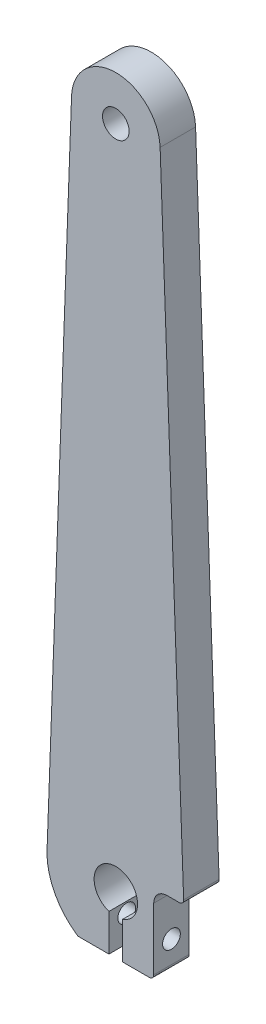
ISO-10303-21;
HEADER;
FILE_DESCRIPTION(('STEP AP214'),'2;1');
FILE_NAME('part.step','',(''),(''),'','','');
FILE_SCHEMA(('AUTOMOTIVE_DESIGN { 1 0 10303 214 1 1 1 1 }'));
ENDSEC;
DATA;
#1=APPLICATION_CONTEXT('core data for automotive mechanical design processes');
#2=APPLICATION_PROTOCOL_DEFINITION('international standard','automotive_design',2000,#1);
#3=PRODUCT_CONTEXT('',#1,'mechanical');
#4=PRODUCT('Part','Part','',(#3));
#5=PRODUCT_RELATED_PRODUCT_CATEGORY('part','',(#4));
#6=PRODUCT_DEFINITION_FORMATION('','',#4);
#7=PRODUCT_DEFINITION_CONTEXT('part definition',#1,'design');
#8=PRODUCT_DEFINITION('design','',#6,#7);
#9=PRODUCT_DEFINITION_SHAPE('','',#8);
#10=(LENGTH_UNIT() NAMED_UNIT(*) SI_UNIT(.MILLI.,.METRE.));
#11=(NAMED_UNIT(*) PLANE_ANGLE_UNIT() SI_UNIT($,.RADIAN.));
#12=(NAMED_UNIT(*) SI_UNIT($,.STERADIAN.) SOLID_ANGLE_UNIT());
#13=UNCERTAINTY_MEASURE_WITH_UNIT(LENGTH_MEASURE(1.E-05),#10,'distance_accuracy_value','');
#14=(GEOMETRIC_REPRESENTATION_CONTEXT(3) GLOBAL_UNCERTAINTY_ASSIGNED_CONTEXT((#13)) GLOBAL_UNIT_ASSIGNED_CONTEXT((#10,
#11,#12)) REPRESENTATION_CONTEXT('',''));
#15=CARTESIAN_POINT('',(0.,0.,0.));
#16=DIRECTION('',(0.,0.,1.));
#17=DIRECTION('',(1.,0.,0.));
#18=AXIS2_PLACEMENT_3D('',#15,#16,#17);
#19=CARTESIAN_POINT('',(0.,0.,8.));
#20=DIRECTION('',(0.,0.,-1.));
#21=DIRECTION('',(-1.,0.,0.));
#22=AXIS2_PLACEMENT_3D('',#19,#20,#21);
#23=PLANE('',#22);
#24=CARTESIAN_POINT('',(0.,76.5,8.));
#25=DIRECTION('',(0.,0.,1.));
#26=DIRECTION('',(1.,0.,0.));
#27=AXIS2_PLACEMENT_3D('',#24,#25,#26);
#28=CIRCLE('',#27,3.);
#29=CARTESIAN_POINT('',(3.,76.5,8.));
#30=VERTEX_POINT('',#29);
#31=EDGE_CURVE('E251',#30,#30,#28,.T.);
#32=ORIENTED_EDGE('',*,*,#31,.F.);
#33=EDGE_LOOP('',(#32));
#34=FACE_BOUND('',#33,.T.);
#35=CARTESIAN_POINT('',(0.,-73.5,8.));
#36=DIRECTION('',(0.,0.,1.));
#37=DIRECTION('',(1.,0.,0.));
#38=AXIS2_PLACEMENT_3D('',#35,#36,#37);
#39=CIRCLE('',#38,15.55);
#40=CARTESIAN_POINT('',(-15.4599665783032,-71.8290920439028,8.));
#41=VERTEX_POINT('',#40);
#42=CARTESIAN_POINT('',(-8.66013745469483,-86.4152823920266,8.));
#43=VERTEX_POINT('',#42);
#44=EDGE_CURVE('E205',#41,#43,#39,.T.);
#45=ORIENTED_EDGE('',*,*,#44,.T.);
#46=CARTESIAN_POINT('',(-8.38167644328986,-86.,8.));
#47=DIRECTION('',(0.,0.,-1.));
#48=DIRECTION('',(-1.,0.,0.));
#49=AXIS2_PLACEMENT_3D('',#46,#47,#48);
#50=CIRCLE('',#49,0.5);
#51=CARTESIAN_POINT('',(-8.38167644328986,-86.5,8.));
#52=VERTEX_POINT('',#51);
#53=EDGE_CURVE('E103',#43,#52,#50,.F.);
#54=ORIENTED_EDGE('',*,*,#53,.T.);
#55=DIRECTION('',(1.,0.,0.));
#56=VECTOR('',#55,1.);
#57=CARTESIAN_POINT('',(-16.,-86.5,8.));
#58=LINE('',#57,#56);
#59=CARTESIAN_POINT('',(-1.55,-86.5,8.));
#60=VERTEX_POINT('',#59);
#61=EDGE_CURVE('E299',#52,#60,#58,.T.);
#62=ORIENTED_EDGE('',*,*,#61,.T.);
#63=DIRECTION('',(0.,1.,0.));
#64=VECTOR('',#63,1.);
#65=CARTESIAN_POINT('',(-1.54999999999993,0.,8.));
#66=LINE('',#65,#64);
#67=CARTESIAN_POINT('',(-1.54999999999999,-78.15,8.));
#68=VERTEX_POINT('',#67);
#69=EDGE_CURVE('E256',#60,#68,#66,.T.);
#70=ORIENTED_EDGE('',*,*,#69,.T.);
#71=DIRECTION('',(1.,0.,0.));
#72=VECTOR('',#71,1.);
#73=CARTESIAN_POINT('',(0.,-78.15,8.));
#74=LINE('',#73,#72);
#75=CARTESIAN_POINT('',(-1.54515371403625,-78.15,8.));
#76=VERTEX_POINT('',#75);
#77=EDGE_CURVE('E277',#68,#76,#74,.T.);
#78=ORIENTED_EDGE('',*,*,#77,.T.);
#79=CARTESIAN_POINT('',(0.,-73.5,8.));
#80=DIRECTION('',(0.,0.,1.));
#81=DIRECTION('',(1.,0.,0.));
#82=AXIS2_PLACEMENT_3D('',#79,#80,#81);
#83=CIRCLE('',#82,4.9);
#84=CARTESIAN_POINT('',(1.54515371403625,-78.15,8.));
#85=VERTEX_POINT('',#84);
#86=EDGE_CURVE('E274',#85,#76,#83,.T.);
#87=ORIENTED_EDGE('',*,*,#86,.F.);
#88=DIRECTION('',(1.,0.,0.));
#89=VECTOR('',#88,1.);
#90=CARTESIAN_POINT('',(0.,-78.15,8.));
#91=LINE('',#90,#89);
#92=CARTESIAN_POINT('',(1.55000000000001,-78.15,8.));
#93=VERTEX_POINT('',#92);
#94=EDGE_CURVE('E270',#85,#93,#91,.T.);
#95=ORIENTED_EDGE('',*,*,#94,.T.);
#96=DIRECTION('',(0.,1.,0.));
#97=VECTOR('',#96,1.);
#98=CARTESIAN_POINT('',(1.55000000000011,0.,8.));
#99=LINE('',#98,#97);
#100=CARTESIAN_POINT('',(1.55,-86.5,8.));
#101=VERTEX_POINT('',#100);
#102=EDGE_CURVE('E267',#101,#93,#99,.T.);
#103=ORIENTED_EDGE('',*,*,#102,.F.);
#104=CARTESIAN_POINT('',(7.55,-86.5,8.));
#105=VERTEX_POINT('',#104);
#106=EDGE_CURVE('E302',#101,#105,#58,.T.);
#107=ORIENTED_EDGE('',*,*,#106,.T.);
#108=CARTESIAN_POINT('',(7.55,-85.5,8.));
#109=DIRECTION('',(0.,0.,-1.));
#110=DIRECTION('',(-1.,0.,0.));
#111=AXIS2_PLACEMENT_3D('',#108,#109,#110);
#112=CIRCLE('',#111,1.);
#113=CARTESIAN_POINT('',(8.55,-85.5,8.));
#114=VERTEX_POINT('',#113);
#115=EDGE_CURVE('E307',#105,#114,#112,.F.);
#116=ORIENTED_EDGE('',*,*,#115,.T.);
#117=DIRECTION('',(0.,1.,0.));
#118=VECTOR('',#117,1.);
#119=CARTESIAN_POINT('',(8.55,0.,8.));
#120=LINE('',#119,#118);
#121=CARTESIAN_POINT('',(8.55,-71.5,8.));
#122=VERTEX_POINT('',#121);
#123=EDGE_CURVE('E234',#114,#122,#120,.T.);
#124=ORIENTED_EDGE('',*,*,#123,.T.);
#125=CARTESIAN_POINT('',(11.55,-71.5,8.));
#126=DIRECTION('',(0.,0.,-1.));
#127=DIRECTION('',(-1.,0.,0.));
#128=AXIS2_PLACEMENT_3D('',#125,#126,#127);
#129=CIRCLE('',#128,3.);
#130=CARTESIAN_POINT('',(11.55,-68.5,8.));
#131=VERTEX_POINT('',#130);
#132=EDGE_CURVE('E328',#122,#131,#129,.T.);
#133=ORIENTED_EDGE('',*,*,#132,.T.);
#134=DIRECTION('',(1.,0.,0.));
#135=VECTOR('',#134,1.);
#136=CARTESIAN_POINT('',(-1.40041945428093E-13,-68.5,8.));
#137=LINE('',#136,#135);
#138=CARTESIAN_POINT('',(14.3007254273132,-68.5,8.));
#139=VERTEX_POINT('',#138);
#140=EDGE_CURVE('E245',#131,#139,#137,.T.);
#141=ORIENTED_EDGE('',*,*,#140,.T.);
#142=CARTESIAN_POINT('',(14.3007254273132,-67.5,8.));
#143=DIRECTION('',(0.,0.,-1.));
#144=DIRECTION('',(-1.,0.,0.));
#145=AXIS2_PLACEMENT_3D('',#142,#143,#144);
#146=CIRCLE('',#145,1.);
#147=CARTESIAN_POINT('',(15.3000501557592,-67.4632564683734,8.));
#148=VERTEX_POINT('',#147);
#149=EDGE_CURVE('E316',#139,#148,#146,.F.);
#150=ORIENTED_EDGE('',*,*,#149,.T.);
#151=DIRECTION('',(-0.036743531626598,0.999324728445967,0.));
#152=VECTOR('',#151,1.);
#153=CARTESIAN_POINT('',(12.8022293464742,0.470716980670182,8.));
#154=LINE('',#153,#152);
#155=CARTESIAN_POINT('',(9.99324728445966,76.867435316266,8.));
#156=VERTEX_POINT('',#155);
#157=EDGE_CURVE('E243',#148,#156,#154,.T.);
#158=ORIENTED_EDGE('',*,*,#157,.T.);
#159=CARTESIAN_POINT('',(0.,76.5,8.));
#160=DIRECTION('',(0.,0.,1.));
#161=DIRECTION('',(1.,0.,0.));
#162=AXIS2_PLACEMENT_3D('',#159,#160,#161);
#163=CIRCLE('',#162,10.);
#164=CARTESIAN_POINT('',(-10.,76.5,8.));
#165=VERTEX_POINT('',#164);
#166=EDGE_CURVE('E229',#156,#165,#163,.T.);
#167=ORIENTED_EDGE('',*,*,#166,.T.);
#168=DIRECTION('',(0.0367849033037923,0.99932320641969,0.));
#169=VECTOR('',#168,1.);
#170=CARTESIAN_POINT('',(-12.7986092839692,0.471114452170644,8.));
#171=LINE('',#170,#169);
#172=EDGE_CURVE('E221',#41,#165,#171,.T.);
#173=ORIENTED_EDGE('',*,*,#172,.F.);
#174=EDGE_LOOP('',(#45,#54,#62,#70,#78,#87,#95,#103,#107,#116,#124,#133,#141,#150,#158,#167,#173));
#175=FACE_BOUND('',#174,.T.);
#176=ADVANCED_FACE('F75',(#34,#175),#23,.F.);
#177=CARTESIAN_POINT('',(0.,0.,0.));
#178=DIRECTION('',(0.,0.,-1.));
#179=DIRECTION('',(-1.,0.,0.));
#180=AXIS2_PLACEMENT_3D('',#177,#178,#179);
#181=PLANE('',#180);
#182=CARTESIAN_POINT('',(0.,76.5,0.));
#183=DIRECTION('',(0.,0.,1.));
#184=DIRECTION('',(1.,0.,0.));
#185=AXIS2_PLACEMENT_3D('',#182,#183,#184);
#186=CIRCLE('',#185,3.);
#187=CARTESIAN_POINT('',(3.,76.5,0.));
#188=VERTEX_POINT('',#187);
#189=EDGE_CURVE('E271',#188,#188,#186,.T.);
#190=ORIENTED_EDGE('',*,*,#189,.T.);
#191=EDGE_LOOP('',(#190));
#192=FACE_BOUND('',#191,.T.);
#193=DIRECTION('',(1.,0.,0.));
#194=VECTOR('',#193,1.);
#195=CARTESIAN_POINT('',(-16.,-86.5,0.));
#196=LINE('',#195,#194);
#197=CARTESIAN_POINT('',(-8.38167644328986,-86.5,0.));
#198=VERTEX_POINT('',#197);
#199=CARTESIAN_POINT('',(-1.55,-86.5,0.));
#200=VERTEX_POINT('',#199);
#201=EDGE_CURVE('E303',#198,#200,#196,.T.);
#202=ORIENTED_EDGE('',*,*,#201,.F.);
#203=CARTESIAN_POINT('',(-8.38167644328986,-86.,0.));
#204=DIRECTION('',(0.,0.,-1.));
#205=DIRECTION('',(-1.,0.,0.));
#206=AXIS2_PLACEMENT_3D('',#203,#204,#205);
#207=CIRCLE('',#206,0.5);
#208=CARTESIAN_POINT('',(-8.66013745469483,-86.4152823920266,0.));
#209=VERTEX_POINT('',#208);
#210=EDGE_CURVE('E12',#198,#209,#207,.T.);
#211=ORIENTED_EDGE('',*,*,#210,.T.);
#212=CARTESIAN_POINT('',(0.,-73.5,0.));
#213=DIRECTION('',(0.,0.,1.));
#214=DIRECTION('',(1.,0.,0.));
#215=AXIS2_PLACEMENT_3D('',#212,#213,#214);
#216=CIRCLE('',#215,15.55);
#217=CARTESIAN_POINT('',(-15.4599665783032,-71.8290920439028,0.));
#218=VERTEX_POINT('',#217);
#219=EDGE_CURVE('E203',#218,#209,#216,.T.);
#220=ORIENTED_EDGE('',*,*,#219,.F.);
#221=DIRECTION('',(0.0367849033037923,0.99932320641969,0.));
#222=VECTOR('',#221,1.);
#223=CARTESIAN_POINT('',(-12.7986092839692,0.471114452170644,0.));
#224=LINE('',#223,#222);
#225=CARTESIAN_POINT('',(-10.,76.5,0.));
#226=VERTEX_POINT('',#225);
#227=EDGE_CURVE('E210',#218,#226,#224,.T.);
#228=ORIENTED_EDGE('',*,*,#227,.T.);
#229=CARTESIAN_POINT('',(0.,76.5,0.));
#230=DIRECTION('',(0.,0.,1.));
#231=DIRECTION('',(1.,0.,0.));
#232=AXIS2_PLACEMENT_3D('',#229,#230,#231);
#233=CIRCLE('',#232,10.);
#234=CARTESIAN_POINT('',(9.99324728445966,76.867435316266,0.));
#235=VERTEX_POINT('',#234);
#236=EDGE_CURVE('E231',#235,#226,#233,.T.);
#237=ORIENTED_EDGE('',*,*,#236,.F.);
#238=DIRECTION('',(-0.036743531626598,0.999324728445967,0.));
#239=VECTOR('',#238,1.);
#240=CARTESIAN_POINT('',(12.8022293464742,0.470716980670182,0.));
#241=LINE('',#240,#239);
#242=CARTESIAN_POINT('',(15.3000501557592,-67.4632564683734,0.));
#243=VERTEX_POINT('',#242);
#244=EDGE_CURVE('E233',#243,#235,#241,.T.);
#245=ORIENTED_EDGE('',*,*,#244,.F.);
#246=CARTESIAN_POINT('',(14.3007254273132,-67.5,0.));
#247=DIRECTION('',(0.,0.,-1.));
#248=DIRECTION('',(-1.,0.,0.));
#249=AXIS2_PLACEMENT_3D('',#246,#247,#248);
#250=CIRCLE('',#249,1.);
#251=CARTESIAN_POINT('',(14.3007254273132,-68.5,0.));
#252=VERTEX_POINT('',#251);
#253=EDGE_CURVE('E320',#243,#252,#250,.T.);
#254=ORIENTED_EDGE('',*,*,#253,.T.);
#255=DIRECTION('',(1.,0.,0.));
#256=VECTOR('',#255,1.);
#257=CARTESIAN_POINT('',(-1.40041945428093E-13,-68.5,0.));
#258=LINE('',#257,#256);
#259=CARTESIAN_POINT('',(11.55,-68.5,0.));
#260=VERTEX_POINT('',#259);
#261=EDGE_CURVE('E236',#260,#252,#258,.T.);
#262=ORIENTED_EDGE('',*,*,#261,.F.);
#263=CARTESIAN_POINT('',(11.55,-71.5,0.));
#264=DIRECTION('',(0.,0.,-1.));
#265=DIRECTION('',(-1.,0.,0.));
#266=AXIS2_PLACEMENT_3D('',#263,#264,#265);
#267=CIRCLE('',#266,3.);
#268=CARTESIAN_POINT('',(8.55,-71.5,0.));
#269=VERTEX_POINT('',#268);
#270=EDGE_CURVE('E330',#260,#269,#267,.F.);
#271=ORIENTED_EDGE('',*,*,#270,.T.);
#272=DIRECTION('',(0.,1.,0.));
#273=VECTOR('',#272,1.);
#274=CARTESIAN_POINT('',(8.55,0.,0.));
#275=LINE('',#274,#273);
#276=CARTESIAN_POINT('',(8.55,-85.5,0.));
#277=VERTEX_POINT('',#276);
#278=EDGE_CURVE('E238',#277,#269,#275,.T.);
#279=ORIENTED_EDGE('',*,*,#278,.F.);
#280=CARTESIAN_POINT('',(7.55,-85.5,0.));
#281=DIRECTION('',(0.,0.,-1.));
#282=DIRECTION('',(-1.,0.,0.));
#283=AXIS2_PLACEMENT_3D('',#280,#281,#282);
#284=CIRCLE('',#283,1.);
#285=CARTESIAN_POINT('',(7.55,-86.5,0.));
#286=VERTEX_POINT('',#285);
#287=EDGE_CURVE('E311',#277,#286,#284,.T.);
#288=ORIENTED_EDGE('',*,*,#287,.T.);
#289=CARTESIAN_POINT('',(1.55,-86.5,0.));
#290=VERTEX_POINT('',#289);
#291=EDGE_CURVE('E285',#290,#286,#196,.T.);
#292=ORIENTED_EDGE('',*,*,#291,.F.);
#293=DIRECTION('',(0.,1.,0.));
#294=VECTOR('',#293,1.);
#295=CARTESIAN_POINT('',(1.55000000000011,0.,0.));
#296=LINE('',#295,#294);
#297=CARTESIAN_POINT('',(1.55000000000001,-78.15,0.));
#298=VERTEX_POINT('',#297);
#299=EDGE_CURVE('E252',#290,#298,#296,.T.);
#300=ORIENTED_EDGE('',*,*,#299,.T.);
#301=DIRECTION('',(1.,0.,0.));
#302=VECTOR('',#301,1.);
#303=CARTESIAN_POINT('',(0.,-78.15,0.));
#304=LINE('',#303,#302);
#305=CARTESIAN_POINT('',(1.54515371403625,-78.15,0.));
#306=VERTEX_POINT('',#305);
#307=EDGE_CURVE('E255',#306,#298,#304,.T.);
#308=ORIENTED_EDGE('',*,*,#307,.F.);
#309=CARTESIAN_POINT('',(0.,-73.5,0.));
#310=DIRECTION('',(0.,0.,1.));
#311=DIRECTION('',(1.,0.,0.));
#312=AXIS2_PLACEMENT_3D('',#309,#310,#311);
#313=CIRCLE('',#312,4.9);
#314=CARTESIAN_POINT('',(-1.54515371403625,-78.15,0.));
#315=VERTEX_POINT('',#314);
#316=EDGE_CURVE('E259',#306,#315,#313,.T.);
#317=ORIENTED_EDGE('',*,*,#316,.T.);
#318=DIRECTION('',(1.,0.,0.));
#319=VECTOR('',#318,1.);
#320=CARTESIAN_POINT('',(0.,-78.15,0.));
#321=LINE('',#320,#319);
#322=CARTESIAN_POINT('',(-1.54999999999999,-78.15,0.));
#323=VERTEX_POINT('',#322);
#324=EDGE_CURVE('E262',#323,#315,#321,.T.);
#325=ORIENTED_EDGE('',*,*,#324,.F.);
#326=DIRECTION('',(0.,1.,0.));
#327=VECTOR('',#326,1.);
#328=CARTESIAN_POINT('',(-1.54999999999993,0.,0.));
#329=LINE('',#328,#327);
#330=EDGE_CURVE('E264',#200,#323,#329,.T.);
#331=ORIENTED_EDGE('',*,*,#330,.F.);
#332=EDGE_LOOP('',(#202,#211,#220,#228,#237,#245,#254,#262,#271,#279,#288,#292,#300,#308,#317,
#325,#331));
#333=FACE_BOUND('',#332,.T.);
#334=ADVANCED_FACE('F219',(#192,#333),#181,.T.);
#335=CARTESIAN_POINT('',(-16.,-86.5,8.));
#336=DIRECTION('',(0.,1.,0.));
#337=DIRECTION('',(0.,0.,1.));
#338=AXIS2_PLACEMENT_3D('',#335,#336,#337);
#339=PLANE('',#338);
#340=ORIENTED_EDGE('',*,*,#61,.F.);
#341=DIRECTION('',(0.,0.,-1.));
#342=VECTOR('',#341,1.);
#343=CARTESIAN_POINT('',(-8.38167644328986,-86.5,0.));
#344=LINE('',#343,#342);
#345=EDGE_CURVE('E89',#52,#198,#344,.T.);
#346=ORIENTED_EDGE('',*,*,#345,.T.);
#347=ORIENTED_EDGE('',*,*,#201,.T.);
#348=DIRECTION('',(0.,0.,1.));
#349=VECTOR('',#348,1.);
#350=CARTESIAN_POINT('',(-1.55,-86.5,0.));
#351=LINE('',#350,#349);
#352=EDGE_CURVE('E282',#200,#60,#351,.T.);
#353=ORIENTED_EDGE('',*,*,#352,.T.);
#354=EDGE_LOOP('',(#340,#346,#347,#353));
#355=FACE_BOUND('',#354,.T.);
#356=ADVANCED_FACE('F396',(#355),#339,.F.);
#357=ORIENTED_EDGE('',*,*,#291,.T.);
#358=DIRECTION('',(0.,0.,1.));
#359=VECTOR('',#358,1.);
#360=CARTESIAN_POINT('',(7.55,-86.5,8.));
#361=LINE('',#360,#359);
#362=EDGE_CURVE('E301',#286,#105,#361,.T.);
#363=ORIENTED_EDGE('',*,*,#362,.T.);
#364=ORIENTED_EDGE('',*,*,#106,.F.);
#365=DIRECTION('',(0.,0.,1.));
#366=VECTOR('',#365,1.);
#367=CARTESIAN_POINT('',(1.55,-86.5,0.));
#368=LINE('',#367,#366);
#369=EDGE_CURVE('E266',#290,#101,#368,.T.);
#370=ORIENTED_EDGE('',*,*,#369,.F.);
#371=EDGE_LOOP('',(#357,#363,#364,#370));
#372=FACE_BOUND('',#371,.T.);
#373=ADVANCED_FACE('F372',(#372),#339,.F.);
#374=CARTESIAN_POINT('',(0.,76.5,0.));
#375=DIRECTION('',(0.,0.,1.));
#376=DIRECTION('',(1.,0.,0.));
#377=AXIS2_PLACEMENT_3D('',#374,#375,#376);
#378=CYLINDRICAL_SURFACE('',#377,3.);
#379=ORIENTED_EDGE('',*,*,#189,.F.);
#380=EDGE_LOOP('',(#379));
#381=FACE_BOUND('',#380,.T.);
#382=ORIENTED_EDGE('',*,*,#31,.T.);
#383=EDGE_LOOP('',(#382));
#384=FACE_BOUND('',#383,.T.);
#385=ADVANCED_FACE('F415',(#381,#384),#378,.F.);
#386=CARTESIAN_POINT('',(-1.54999999999993,0.,0.));
#387=DIRECTION('',(1.,0.,0.));
#388=DIRECTION('',(0.,1.,0.));
#389=AXIS2_PLACEMENT_3D('',#386,#387,#388);
#390=PLANE('',#389);
#391=CARTESIAN_POINT('',(-1.54999999999999,-80.5,4.));
#392=DIRECTION('',(1.,0.,0.));
#393=DIRECTION('',(0.,1.,0.));
#394=AXIS2_PLACEMENT_3D('',#391,#392,#393);
#395=CIRCLE('',#394,2.);
#396=CARTESIAN_POINT('',(-1.54999999999999,-78.5,4.));
#397=VERTEX_POINT('',#396);
#398=EDGE_CURVE('E225',#397,#397,#395,.T.);
#399=ORIENTED_EDGE('',*,*,#398,.F.);
#400=EDGE_LOOP('',(#399));
#401=FACE_BOUND('',#400,.T.);
#402=ORIENTED_EDGE('',*,*,#69,.F.);
#403=ORIENTED_EDGE('',*,*,#352,.F.);
#404=ORIENTED_EDGE('',*,*,#330,.T.);
#405=DIRECTION('',(0.,0.,1.));
#406=VECTOR('',#405,1.);
#407=CARTESIAN_POINT('',(-1.54999999999999,-78.15,0.));
#408=LINE('',#407,#406);
#409=EDGE_CURVE('E286',#323,#68,#408,.T.);
#410=ORIENTED_EDGE('',*,*,#409,.T.);
#411=EDGE_LOOP('',(#402,#403,#404,#410));
#412=FACE_BOUND('',#411,.T.);
#413=ADVANCED_FACE('F394',(#401,#412),#390,.T.);
#414=CARTESIAN_POINT('',(0.,-78.15,0.));
#415=DIRECTION('',(0.,-1.,0.));
#416=DIRECTION('',(0.,0.,-1.));
#417=AXIS2_PLACEMENT_3D('',#414,#415,#416);
#418=PLANE('',#417);
#419=ORIENTED_EDGE('',*,*,#77,.F.);
#420=ORIENTED_EDGE('',*,*,#409,.F.);
#421=ORIENTED_EDGE('',*,*,#324,.T.);
#422=DIRECTION('',(0.,0.,1.));
#423=VECTOR('',#422,1.);
#424=CARTESIAN_POINT('',(-1.54515371403625,-78.15,0.));
#425=LINE('',#424,#423);
#426=EDGE_CURVE('E288',#315,#76,#425,.T.);
#427=ORIENTED_EDGE('',*,*,#426,.T.);
#428=EDGE_LOOP('',(#419,#420,#421,#427));
#429=FACE_BOUND('',#428,.T.);
#430=ADVANCED_FACE('F391',(#429),#418,.T.);
#431=CARTESIAN_POINT('',(0.,-73.5,0.));
#432=DIRECTION('',(0.,0.,1.));
#433=DIRECTION('',(1.,0.,0.));
#434=AXIS2_PLACEMENT_3D('',#431,#432,#433);
#435=CYLINDRICAL_SURFACE('',#434,4.9);
#436=ORIENTED_EDGE('',*,*,#86,.T.);
#437=ORIENTED_EDGE('',*,*,#426,.F.);
#438=ORIENTED_EDGE('',*,*,#316,.F.);
#439=DIRECTION('',(0.,0.,1.));
#440=VECTOR('',#439,1.);
#441=CARTESIAN_POINT('',(1.54515371403625,-78.15,0.));
#442=LINE('',#441,#440);
#443=EDGE_CURVE('E290',#306,#85,#442,.T.);
#444=ORIENTED_EDGE('',*,*,#443,.T.);
#445=EDGE_LOOP('',(#436,#437,#438,#444));
#446=FACE_BOUND('',#445,.T.);
#447=ADVANCED_FACE('F385',(#446),#435,.F.);
#448=CARTESIAN_POINT('',(0.,-78.15,0.));
#449=DIRECTION('',(0.,-1.,0.));
#450=DIRECTION('',(0.,0.,-1.));
#451=AXIS2_PLACEMENT_3D('',#448,#449,#450);
#452=PLANE('',#451);
#453=ORIENTED_EDGE('',*,*,#94,.F.);
#454=ORIENTED_EDGE('',*,*,#443,.F.);
#455=ORIENTED_EDGE('',*,*,#307,.T.);
#456=DIRECTION('',(0.,0.,1.));
#457=VECTOR('',#456,1.);
#458=CARTESIAN_POINT('',(1.55000000000001,-78.15,0.));
#459=LINE('',#458,#457);
#460=EDGE_CURVE('E292',#298,#93,#459,.T.);
#461=ORIENTED_EDGE('',*,*,#460,.T.);
#462=EDGE_LOOP('',(#453,#454,#455,#461));
#463=FACE_BOUND('',#462,.T.);
#464=ADVANCED_FACE('F380',(#463),#452,.T.);
#465=CARTESIAN_POINT('',(1.55000000000011,0.,0.));
#466=DIRECTION('',(1.,0.,0.));
#467=DIRECTION('',(0.,1.,0.));
#468=AXIS2_PLACEMENT_3D('',#465,#466,#467);
#469=PLANE('',#468);
#470=CARTESIAN_POINT('',(1.55,-80.5,4.));
#471=DIRECTION('',(1.,0.,0.));
#472=DIRECTION('',(0.,1.,0.));
#473=AXIS2_PLACEMENT_3D('',#470,#471,#472);
#474=CIRCLE('',#473,2.);
#475=CARTESIAN_POINT('',(1.55000000000001,-78.5,4.));
#476=VERTEX_POINT('',#475);
#477=EDGE_CURVE('E594',#476,#476,#474,.T.);
#478=ORIENTED_EDGE('',*,*,#477,.T.);
#479=EDGE_LOOP('',(#478));
#480=FACE_BOUND('',#479,.T.);
#481=ORIENTED_EDGE('',*,*,#102,.T.);
#482=ORIENTED_EDGE('',*,*,#460,.F.);
#483=ORIENTED_EDGE('',*,*,#299,.F.);
#484=ORIENTED_EDGE('',*,*,#369,.T.);
#485=EDGE_LOOP('',(#481,#482,#483,#484));
#486=FACE_BOUND('',#485,.T.);
#487=ADVANCED_FACE('F377',(#480,#486),#469,.F.);
#488=CARTESIAN_POINT('',(0.,76.5,0.));
#489=DIRECTION('',(0.,0.,1.));
#490=DIRECTION('',(1.,0.,0.));
#491=AXIS2_PLACEMENT_3D('',#488,#489,#490);
#492=CYLINDRICAL_SURFACE('',#491,10.);
#493=ORIENTED_EDGE('',*,*,#166,.F.);
#494=DIRECTION('',(0.,0.,1.));
#495=VECTOR('',#494,1.);
#496=CARTESIAN_POINT('',(9.99324728445966,76.867435316266,0.));
#497=LINE('',#496,#495);
#498=EDGE_CURVE('E241',#235,#156,#497,.T.);
#499=ORIENTED_EDGE('',*,*,#498,.F.);
#500=ORIENTED_EDGE('',*,*,#236,.T.);
#501=DIRECTION('',(0.,0.,1.));
#502=VECTOR('',#501,1.);
#503=CARTESIAN_POINT('',(-10.,76.5,0.));
#504=LINE('',#503,#502);
#505=EDGE_CURVE('E209',#226,#165,#504,.T.);
#506=ORIENTED_EDGE('',*,*,#505,.T.);
#507=EDGE_LOOP('',(#493,#499,#500,#506));
#508=FACE_BOUND('',#507,.T.);
#509=ADVANCED_FACE('F340',(#508),#492,.T.);
#510=CARTESIAN_POINT('',(8.55,0.,0.));
#511=DIRECTION('',(1.,0.,0.));
#512=DIRECTION('',(0.,0.,-1.));
#513=AXIS2_PLACEMENT_3D('',#510,#511,#512);
#514=PLANE('',#513);
#515=CARTESIAN_POINT('',(8.55,-80.5,4.));
#516=DIRECTION('',(1.,0.,0.));
#517=DIRECTION('',(0.,0.,-1.));
#518=AXIS2_PLACEMENT_3D('',#515,#516,#517);
#519=CIRCLE('',#518,2.);
#520=CARTESIAN_POINT('',(8.55,-80.5,2.));
#521=VERTEX_POINT('',#520);
#522=EDGE_CURVE('E591',#521,#521,#519,.T.);
#523=ORIENTED_EDGE('',*,*,#522,.F.);
#524=EDGE_LOOP('',(#523));
#525=FACE_BOUND('',#524,.T.);
#526=ORIENTED_EDGE('',*,*,#278,.T.);
#527=DIRECTION('',(0.,0.,1.));
#528=VECTOR('',#527,1.);
#529=CARTESIAN_POINT('',(8.55,-71.5,8.));
#530=LINE('',#529,#528);
#531=EDGE_CURVE('E323',#269,#122,#530,.T.);
#532=ORIENTED_EDGE('',*,*,#531,.T.);
#533=ORIENTED_EDGE('',*,*,#123,.F.);
#534=DIRECTION('',(0.,0.,1.));
#535=VECTOR('',#534,1.);
#536=CARTESIAN_POINT('',(8.55,-85.5,0.));
#537=LINE('',#536,#535);
#538=EDGE_CURVE('E309',#114,#277,#537,.F.);
#539=ORIENTED_EDGE('',*,*,#538,.T.);
#540=EDGE_LOOP('',(#526,#532,#533,#539));
#541=FACE_BOUND('',#540,.T.);
#542=ADVANCED_FACE('F361',(#525,#541),#514,.T.);
#543=CARTESIAN_POINT('',(-1.40041945428093E-13,-68.5,0.));
#544=DIRECTION('',(0.,-1.,0.));
#545=DIRECTION('',(1.,0.,0.));
#546=AXIS2_PLACEMENT_3D('',#543,#544,#545);
#547=PLANE('',#546);
#548=ORIENTED_EDGE('',*,*,#140,.F.);
#549=DIRECTION('',(0.,0.,1.));
#550=VECTOR('',#549,1.);
#551=CARTESIAN_POINT('',(11.55,-68.5,0.));
#552=LINE('',#551,#550);
#553=EDGE_CURVE('E326',#131,#260,#552,.F.);
#554=ORIENTED_EDGE('',*,*,#553,.T.);
#555=ORIENTED_EDGE('',*,*,#261,.T.);
#556=DIRECTION('',(0.,0.,1.));
#557=VECTOR('',#556,1.);
#558=CARTESIAN_POINT('',(14.3007254273132,-68.5,0.));
#559=LINE('',#558,#557);
#560=EDGE_CURVE('E313',#252,#139,#559,.T.);
#561=ORIENTED_EDGE('',*,*,#560,.T.);
#562=EDGE_LOOP('',(#548,#554,#555,#561));
#563=FACE_BOUND('',#562,.T.);
#564=ADVANCED_FACE('F352',(#563),#547,.T.);
#565=CARTESIAN_POINT('',(12.8022293464742,0.470716980670182,0.));
#566=DIRECTION('',(0.999324728445967,0.036743531626598,0.));
#567=DIRECTION('',(-0.036743531626598,0.999324728445967,0.));
#568=AXIS2_PLACEMENT_3D('',#565,#566,#567);
#569=PLANE('',#568);
#570=ORIENTED_EDGE('',*,*,#157,.F.);
#571=DIRECTION('',(0.,0.,1.));
#572=VECTOR('',#571,1.);
#573=CARTESIAN_POINT('',(15.3000501557592,-67.4632564683734,0.));
#574=LINE('',#573,#572);
#575=EDGE_CURVE('E318',#148,#243,#574,.F.);
#576=ORIENTED_EDGE('',*,*,#575,.T.);
#577=ORIENTED_EDGE('',*,*,#244,.T.);
#578=ORIENTED_EDGE('',*,*,#498,.T.);
#579=EDGE_LOOP('',(#570,#576,#577,#578));
#580=FACE_BOUND('',#579,.T.);
#581=ADVANCED_FACE('F504',(#580),#569,.T.);
#582=CARTESIAN_POINT('',(0.,-73.5,0.));
#583=DIRECTION('',(0.,0.,1.));
#584=DIRECTION('',(1.,0.,0.));
#585=AXIS2_PLACEMENT_3D('',#582,#583,#584);
#586=CYLINDRICAL_SURFACE('',#585,15.55);
#587=CARTESIAN_POINT('',(-13.8853339895013,-80.5,2.));
#588=CARTESIAN_POINT('',(-13.8209421771535,-80.6277247859312,2.00000196171208));
#589=CARTESIAN_POINT('',(-13.7547585739413,-80.7545832543708,2.01224683950857));
#590=CARTESIAN_POINT('',(-13.6208291244714,-81.0030316698416,2.06015597231627));
#591=CARTESIAN_POINT('',(-13.5530818625719,-81.124616530866,2.09584232207521));
#592=CARTESIAN_POINT('',(-13.4183373005247,-81.3593283259995,2.18960418327238));
#593=CARTESIAN_POINT('',(-13.3513401798869,-81.4724532709261,2.24768494067547));
#594=CARTESIAN_POINT('',(-13.2208370372685,-81.6870454211317,2.38533340951697));
#595=CARTESIAN_POINT('',(-13.1573284435025,-81.7885212760893,2.46488502939382));
#596=CARTESIAN_POINT('',(-13.0478348690648,-81.959606712528,2.62851537467571));
#597=CARTESIAN_POINT('',(-13.0007403182054,-82.0316754723855,2.7092844690372));
#598=CARTESIAN_POINT('',(-12.9134995973377,-82.1631542626493,2.88383725476389));
#599=CARTESIAN_POINT('',(-12.8733452313952,-82.2225792440214,2.97760535587308));
#600=CARTESIAN_POINT('',(-12.8079647901553,-82.3182416824653,3.16151479293116));
#601=CARTESIAN_POINT('',(-12.781399332257,-82.356626949136,3.25005894017409));
#602=CARTESIAN_POINT('',(-12.7368250831663,-82.4206119445116,3.43370918065697));
#603=CARTESIAN_POINT('',(-12.718811527508,-82.4462187927815,3.52881158623217));
#604=CARTESIAN_POINT('',(-12.6926568192975,-82.4832897505353,3.72355029722122));
#605=CARTESIAN_POINT('',(-12.6845607871674,-82.4946892267106,3.82320520014548));
#606=CARTESIAN_POINT('',(-12.6791127405493,-82.5023678987447,4.02338574118209));
#607=CARTESIAN_POINT('',(-12.6817582884329,-82.4986505251283,4.12391117657463));
#608=CARTESIAN_POINT('',(-12.6969185216799,-82.4772435377624,4.31463753459329));
#609=CARTESIAN_POINT('',(-12.7086456971275,-82.4606686704466,4.4050313250083));
#610=CARTESIAN_POINT('',(-12.7401625335945,-82.4158007697671,4.58136853339866));
#611=CARTESIAN_POINT('',(-12.7599534964998,-82.3875058442059,4.66731123022535));
#612=CARTESIAN_POINT('',(-12.8074766021345,-82.3188918923683,4.83689415930942));
#613=CARTESIAN_POINT('',(-12.835538039503,-82.2780705796084,4.92023670813095));
#614=CARTESIAN_POINT('',(-12.8976458794027,-82.1865578273895,5.07885058634438));
#615=CARTESIAN_POINT('',(-12.9316949029479,-82.1358620644251,5.15411835774504));
#616=CARTESIAN_POINT('',(-13.0098067565469,-82.0178135056462,5.30647342552159));
#617=CARTESIAN_POINT('',(-13.0546054333065,-81.9491020257365,5.38212864561688));
#618=CARTESIAN_POINT('',(-13.1482942775143,-81.8025560044915,5.52103826344709));
#619=CARTESIAN_POINT('',(-13.1971869948985,-81.7247157651202,5.58428484936385));
#620=CARTESIAN_POINT('',(-13.3058572227339,-81.5479267701586,5.70742759648333));
#621=CARTESIAN_POINT('',(-13.3660868068615,-81.4476256857196,5.76499085769907));
#622=CARTESIAN_POINT('',(-13.4878056417062,-81.2392624820507,5.86190979206636));
#623=CARTESIAN_POINT('',(-13.549295594029,-81.1311959513006,5.90125501963396));
#624=CARTESIAN_POINT('',(-13.6777797764382,-80.8986581863806,5.96391336080688));
#625=CARTESIAN_POINT('',(-13.7447187512818,-80.7736201960344,5.98526256957252));
#626=CARTESIAN_POINT('',(-13.875822761186,-80.5202836289358,6.00392538582213));
#627=CARTESIAN_POINT('',(-13.93998756059,-80.3919847766486,6.00123695540701));
#628=CARTESIAN_POINT('',(-14.0629246220607,-80.1374982922413,5.97099367327662));
#629=CARTESIAN_POINT('',(-14.1217503782854,-80.011303341286,5.94372492314671));
#630=CARTESIAN_POINT('',(-14.2331307999505,-79.7640915017309,5.86420656861385));
#631=CARTESIAN_POINT('',(-14.2856890759452,-79.6430716578956,5.81197143449893));
#632=CARTESIAN_POINT('',(-14.3789265575715,-79.421335431341,5.68854393769749));
#633=CARTESIAN_POINT('',(-14.4202378990372,-79.3197678885688,5.61936095178219));
#634=CARTESIAN_POINT('',(-14.4955549553874,-79.1295519003559,5.46187751615124));
#635=CARTESIAN_POINT('',(-14.5295652239895,-79.0408954133858,5.37358905203598));
#636=CARTESIAN_POINT('',(-14.5869061367701,-78.8880181161703,5.18933092218399));
#637=CARTESIAN_POINT('',(-14.6109320717993,-78.8222984584609,5.09481860592951));
#638=CARTESIAN_POINT('',(-14.6521995699049,-78.7076173316367,4.89478326099322));
#639=CARTESIAN_POINT('',(-14.6694437780398,-78.6586493298909,4.78926454546462));
#640=CARTESIAN_POINT('',(-14.6961766580831,-78.581972804425,4.57716371000047));
#641=CARTESIAN_POINT('',(-14.7060709986261,-78.5531584621473,4.47103111922438));
#642=CARTESIAN_POINT('',(-14.7197063855792,-78.5133019565842,4.25509997464114));
#643=CARTESIAN_POINT('',(-14.7234486282978,-78.5022563380845,4.14530213779858));
#644=CARTESIAN_POINT('',(-14.7247508814637,-78.4984209310764,3.92836223529668));
#645=CARTESIAN_POINT('',(-14.7224767641646,-78.5051413261516,3.82122943488104));
#646=CARTESIAN_POINT('',(-14.7121047716154,-78.5355463912659,3.60969565859905));
#647=CARTESIAN_POINT('',(-14.7040072552336,-78.559230015942,3.50529451480465));
#648=CARTESIAN_POINT('',(-14.6820471107492,-78.6226071882317,3.30238299683419));
#649=CARTESIAN_POINT('',(-14.6681975101934,-78.6622645518073,3.20385988289372));
#650=CARTESIAN_POINT('',(-14.6348193273461,-78.756142439644,3.0150754014623));
#651=CARTESIAN_POINT('',(-14.615290526698,-78.8103635238521,2.92481435181075));
#652=CARTESIAN_POINT('',(-14.5702616116806,-78.9327062198446,2.7530293532474));
#653=CARTESIAN_POINT('',(-14.5446473844105,-79.0010897981384,2.67172222572225));
#654=CARTESIAN_POINT('',(-14.4879702669793,-79.1486685990187,2.52183468591839));
#655=CARTESIAN_POINT('',(-14.4569063340135,-79.2278658901717,2.4532567145496));
#656=CARTESIAN_POINT('',(-14.3881792525762,-79.3984427981285,2.32717607029197));
#657=CARTESIAN_POINT('',(-14.3502750268662,-79.4902194371532,2.27034321098871));
#658=CARTESIAN_POINT('',(-14.2696031970485,-79.6799313611282,2.17274072270351));
#659=CARTESIAN_POINT('',(-14.226834850374,-79.7778675853907,2.13197355059539));
#660=CARTESIAN_POINT('',(-14.1362306653156,-79.979346832262,2.06598895207387));
#661=CARTESIAN_POINT('',(-14.0883052662713,-80.0829652928546,2.04112672616344));
#662=CARTESIAN_POINT('',(-13.9890955548132,-80.2912473252736,2.00812775379262));
#663=CARTESIAN_POINT('',(-13.9378097678233,-80.3959113385945,1.99999840131276));
#664=CARTESIAN_POINT('',(-13.8853339895013,-80.5,2.));
#665=B_SPLINE_CURVE_WITH_KNOTS('',3,(#587,#588,#589,#590,#591,#592,#593,#594,#595,#596,#597,
#598,#599,#600,#601,#602,#603,#604,#605,#606,#607,#608,#609,#610,#611,#612,#613,#614,#615,#616,
#617,#618,#619,#620,#621,#622,#623,#624,#625,#626,#627,#628,#629,#630,#631,#632,#633,#634,#635,
#636,#637,#638,#639,#640,#641,#642,#643,#644,#645,#646,#647,#648,#649,#650,#651,#652,#653,#654,
#655,#656,#657,#658,#659,#660,#661,#662,#663,#664),.UNSPECIFIED.,.T.,.F.,(4,2,2,2,2,2,2,2,2,2,2,
2,2,2,2,2,2,2,2,2,2,2,2,2,2,2,2,2,2,2,2,2,2,2,2,2,2,2,4),(0.,0.428684093313923,
0.857772823506249,1.28696213029591,1.71583066561707,2.06857900707428,2.4209078849407,
2.71993783303163,3.01880098843193,3.31901885104965,3.61916858787434,3.89585930675196,
4.17259471462851,4.46232655858949,4.75218554730413,5.08568334853527,5.41939043331257,
5.80895593382486,6.19874452183593,6.62697651514873,7.05524481410126,7.47859176950879,
7.9016936538824,8.2885190045032,8.67510238460854,9.0260651010785,9.37689079644012,
9.70651772070601,10.0360805396698,10.3566525581203,10.6772048229456,10.997035013528,
11.3168775027263,11.6432710692337,11.9697271596097,12.3114854120444,12.6532959082057,
13.0024955462953,13.3518494568425),.UNSPECIFIED.);
#666=CARTESIAN_POINT('',(-13.8853339895013,-80.5,2.));
#667=VERTEX_POINT('',#666);
#668=EDGE_CURVE('E79',#667,#667,#665,.T.);
#669=ORIENTED_EDGE('',*,*,#668,.F.);
#670=EDGE_LOOP('',(#669));
#671=FACE_BOUND('',#670,.T.);
#672=ORIENTED_EDGE('',*,*,#219,.T.);
#673=DIRECTION('',(0.,0.,1.));
#674=VECTOR('',#673,1.);
#675=CARTESIAN_POINT('',(-8.66013745469483,-86.4152823920266,0.));
#676=LINE('',#675,#674);
#677=EDGE_CURVE('E332',#209,#43,#676,.T.);
#678=ORIENTED_EDGE('',*,*,#677,.T.);
#679=ORIENTED_EDGE('',*,*,#44,.F.);
#680=DIRECTION('',(0.,0.,1.));
#681=VECTOR('',#680,1.);
#682=CARTESIAN_POINT('',(-15.4599665783032,-71.8290920439028,0.));
#683=LINE('',#682,#681);
#684=EDGE_CURVE('E198',#218,#41,#683,.T.);
#685=ORIENTED_EDGE('',*,*,#684,.F.);
#686=EDGE_LOOP('',(#672,#678,#679,#685));
#687=FACE_BOUND('',#686,.T.);
#688=ADVANCED_FACE('F200',(#671,#687),#586,.T.);
#689=CARTESIAN_POINT('',(-12.7986092839692,0.471114452170644,0.));
#690=DIRECTION('',(0.99932320641969,-0.0367849033037923,0.));
#691=DIRECTION('',(0.0367849033037923,0.99932320641969,0.));
#692=AXIS2_PLACEMENT_3D('',#689,#690,#691);
#693=PLANE('',#692);
#694=ORIENTED_EDGE('',*,*,#172,.T.);
#695=ORIENTED_EDGE('',*,*,#505,.F.);
#696=ORIENTED_EDGE('',*,*,#227,.F.);
#697=ORIENTED_EDGE('',*,*,#684,.T.);
#698=EDGE_LOOP('',(#694,#695,#696,#697));
#699=FACE_BOUND('',#698,.T.);
#700=ADVANCED_FACE('F214',(#699),#693,.F.);
#701=CARTESIAN_POINT('',(7.55,-85.5,8.));
#702=DIRECTION('',(0.,0.,-1.));
#703=DIRECTION('',(-1.,0.,0.));
#704=AXIS2_PLACEMENT_3D('',#701,#702,#703);
#705=CYLINDRICAL_SURFACE('',#704,1.);
#706=ORIENTED_EDGE('',*,*,#287,.F.);
#707=ORIENTED_EDGE('',*,*,#538,.F.);
#708=ORIENTED_EDGE('',*,*,#115,.F.);
#709=ORIENTED_EDGE('',*,*,#362,.F.);
#710=EDGE_LOOP('',(#706,#707,#708,#709));
#711=FACE_BOUND('',#710,.T.);
#712=ADVANCED_FACE('F369',(#711),#705,.T.);
#713=CARTESIAN_POINT('',(14.3007254273132,-67.5,0.));
#714=DIRECTION('',(0.,0.,1.));
#715=DIRECTION('',(1.,0.,0.));
#716=AXIS2_PLACEMENT_3D('',#713,#714,#715);
#717=CYLINDRICAL_SURFACE('',#716,1.);
#718=ORIENTED_EDGE('',*,*,#253,.F.);
#719=ORIENTED_EDGE('',*,*,#575,.F.);
#720=ORIENTED_EDGE('',*,*,#149,.F.);
#721=ORIENTED_EDGE('',*,*,#560,.F.);
#722=EDGE_LOOP('',(#718,#719,#720,#721));
#723=FACE_BOUND('',#722,.T.);
#724=ADVANCED_FACE('F348',(#723),#717,.T.);
#725=CARTESIAN_POINT('',(11.55,-71.5,0.));
#726=DIRECTION('',(0.,0.,-1.));
#727=DIRECTION('',(-1.,0.,0.));
#728=AXIS2_PLACEMENT_3D('',#725,#726,#727);
#729=CYLINDRICAL_SURFACE('',#728,3.);
#730=ORIENTED_EDGE('',*,*,#270,.F.);
#731=ORIENTED_EDGE('',*,*,#553,.F.);
#732=ORIENTED_EDGE('',*,*,#132,.F.);
#733=ORIENTED_EDGE('',*,*,#531,.F.);
#734=EDGE_LOOP('',(#730,#731,#732,#733));
#735=FACE_BOUND('',#734,.T.);
#736=ADVANCED_FACE('F358',(#735),#729,.F.);
#737=CARTESIAN_POINT('',(-8.38167644328986,-86.,0.));
#738=DIRECTION('',(0.,0.,1.));
#739=DIRECTION('',(1.,0.,0.));
#740=AXIS2_PLACEMENT_3D('',#737,#738,#739);
#741=CYLINDRICAL_SURFACE('',#740,0.5);
#742=ORIENTED_EDGE('',*,*,#210,.F.);
#743=ORIENTED_EDGE('',*,*,#345,.F.);
#744=ORIENTED_EDGE('',*,*,#53,.F.);
#745=ORIENTED_EDGE('',*,*,#677,.F.);
#746=EDGE_LOOP('',(#742,#743,#744,#745));
#747=FACE_BOUND('',#746,.T.);
#748=ADVANCED_FACE('F77',(#747),#741,.T.);
#749=CARTESIAN_POINT('',(-15.55,-80.5,4.));
#750=DIRECTION('',(1.,0.,0.));
#751=DIRECTION('',(0.,0.,-1.));
#752=AXIS2_PLACEMENT_3D('',#749,#750,#751);
#753=CYLINDRICAL_SURFACE('',#752,2.);
#754=ORIENTED_EDGE('',*,*,#398,.T.);
#755=EDGE_LOOP('',(#754));
#756=FACE_BOUND('',#755,.T.);
#757=ORIENTED_EDGE('',*,*,#668,.T.);
#758=EDGE_LOOP('',(#757));
#759=FACE_BOUND('',#758,.T.);
#760=ADVANCED_FACE('F398',(#756,#759),#753,.F.);
#761=ORIENTED_EDGE('',*,*,#522,.T.);
#762=EDGE_LOOP('',(#761));
#763=FACE_BOUND('',#762,.T.);
#764=ORIENTED_EDGE('',*,*,#477,.F.);
#765=EDGE_LOOP('',(#764));
#766=FACE_BOUND('',#765,.T.);
#767=ADVANCED_FACE('F403',(#763,#766),#753,.F.);
#768=CLOSED_SHELL('',(#176,#334,#356,#373,#385,#413,#430,#447,#464,#487,#509,#542,#564,#581,
#688,#700,#712,#724,#736,#748,#760,#767));
#769=MANIFOLD_SOLID_BREP('B2',#768);
#770=ADVANCED_BREP_SHAPE_REPRESENTATION('',(#18,#769),#14);
#771=SHAPE_DEFINITION_REPRESENTATION(#9,#770);
ENDSEC;
END-ISO-10303-21;
